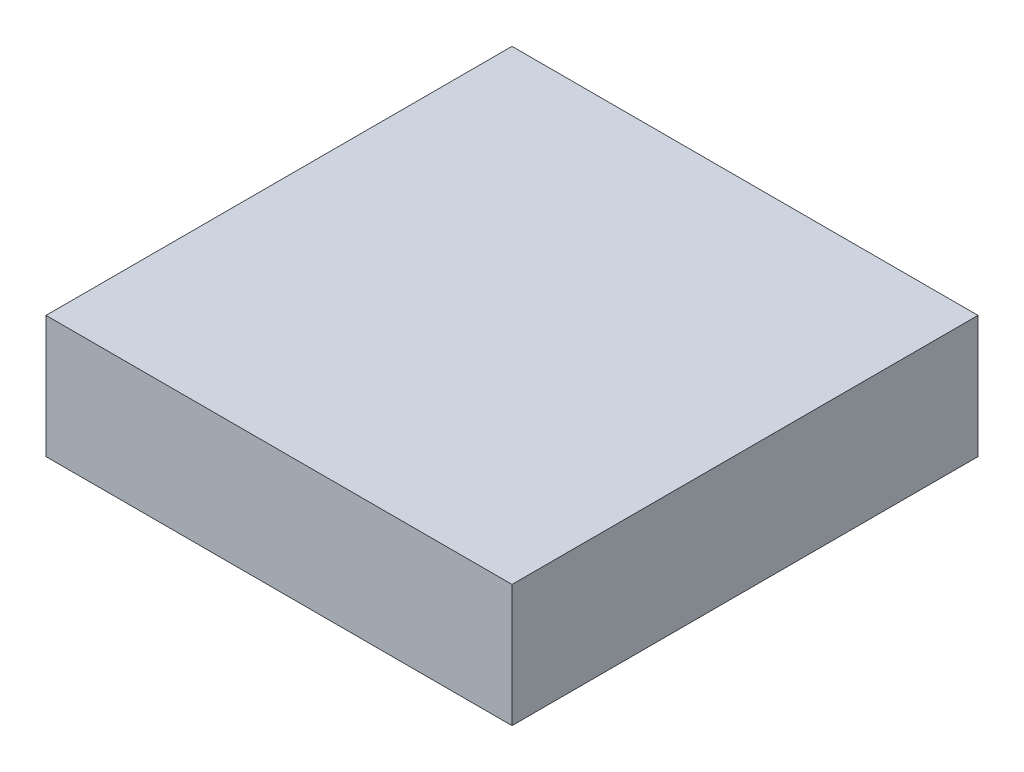
ISO-10303-21;
HEADER;
FILE_DESCRIPTION(('STEP AP214'),'2;1');
FILE_NAME('part.step','',(''),(''),'','','');
FILE_SCHEMA(('AUTOMOTIVE_DESIGN { 1 0 10303 214 1 1 1 1 }'));
ENDSEC;
DATA;
#1=APPLICATION_CONTEXT('core data for automotive mechanical design processes');
#2=APPLICATION_PROTOCOL_DEFINITION('international standard','automotive_design',2000,#1);
#3=PRODUCT_CONTEXT('',#1,'mechanical');
#4=PRODUCT('Part','Part','',(#3));
#5=PRODUCT_RELATED_PRODUCT_CATEGORY('part','',(#4));
#6=PRODUCT_DEFINITION_FORMATION('','',#4);
#7=PRODUCT_DEFINITION_CONTEXT('part definition',#1,'design');
#8=PRODUCT_DEFINITION('design','',#6,#7);
#9=PRODUCT_DEFINITION_SHAPE('','',#8);
#10=(LENGTH_UNIT() NAMED_UNIT(*) SI_UNIT(.MILLI.,.METRE.));
#11=(NAMED_UNIT(*) PLANE_ANGLE_UNIT() SI_UNIT($,.RADIAN.));
#12=(NAMED_UNIT(*) SI_UNIT($,.STERADIAN.) SOLID_ANGLE_UNIT());
#13=UNCERTAINTY_MEASURE_WITH_UNIT(LENGTH_MEASURE(1.E-05),#10,'distance_accuracy_value','');
#14=(GEOMETRIC_REPRESENTATION_CONTEXT(3) GLOBAL_UNCERTAINTY_ASSIGNED_CONTEXT((#13)) GLOBAL_UNIT_ASSIGNED_CONTEXT((#10,
#11,#12)) REPRESENTATION_CONTEXT('',''));
#15=CARTESIAN_POINT('',(0.,0.,0.));
#16=DIRECTION('',(0.,0.,1.));
#17=DIRECTION('',(1.,0.,0.));
#18=AXIS2_PLACEMENT_3D('',#15,#16,#17);
#19=CARTESIAN_POINT('',(-2.,1.05,-2.));
#20=DIRECTION('',(1.,0.,0.));
#21=DIRECTION('',(0.,0.,-1.));
#22=AXIS2_PLACEMENT_3D('',#19,#20,#21);
#23=PLANE('',#22);
#24=DIRECTION('',(0.,0.,1.));
#25=VECTOR('',#24,1.);
#26=CARTESIAN_POINT('',(-2.,0.,-2.));
#27=LINE('',#26,#25);
#28=CARTESIAN_POINT('',(-2.,0.,-2.));
#29=VERTEX_POINT('',#28);
#30=CARTESIAN_POINT('',(-2.,0.,2.));
#31=VERTEX_POINT('',#30);
#32=EDGE_CURVE('E96',#29,#31,#27,.T.);
#33=ORIENTED_EDGE('',*,*,#32,.T.);
#34=DIRECTION('',(0.,-1.,0.));
#35=VECTOR('',#34,1.);
#36=CARTESIAN_POINT('',(-2.,1.05,2.));
#37=LINE('',#36,#35);
#38=CARTESIAN_POINT('',(-2.,1.05,2.));
#39=VERTEX_POINT('',#38);
#40=EDGE_CURVE('E11',#39,#31,#37,.T.);
#41=ORIENTED_EDGE('',*,*,#40,.F.);
#42=DIRECTION('',(0.,0.,1.));
#43=VECTOR('',#42,1.);
#44=CARTESIAN_POINT('',(-2.,1.05,-2.));
#45=LINE('',#44,#43);
#46=CARTESIAN_POINT('',(-2.,1.05,-2.));
#47=VERTEX_POINT('',#46);
#48=EDGE_CURVE('E84',#47,#39,#45,.T.);
#49=ORIENTED_EDGE('',*,*,#48,.F.);
#50=DIRECTION('',(0.,-1.,0.));
#51=VECTOR('',#50,1.);
#52=CARTESIAN_POINT('',(-2.,1.05,-2.));
#53=LINE('',#52,#51);
#54=EDGE_CURVE('E92',#47,#29,#53,.T.);
#55=ORIENTED_EDGE('',*,*,#54,.T.);
#56=EDGE_LOOP('',(#33,#41,#49,#55));
#57=FACE_BOUND('',#56,.T.);
#58=ADVANCED_FACE('F33',(#57),#23,.F.);
#59=CARTESIAN_POINT('',(2.,1.05,2.));
#60=DIRECTION('',(0.,0.,-1.));
#61=DIRECTION('',(-1.,0.,0.));
#62=AXIS2_PLACEMENT_3D('',#59,#60,#61);
#63=PLANE('',#62);
#64=DIRECTION('',(1.,0.,0.));
#65=VECTOR('',#64,1.);
#66=CARTESIAN_POINT('',(2.,0.,2.));
#67=LINE('',#66,#65);
#68=CARTESIAN_POINT('',(2.,0.,2.));
#69=VERTEX_POINT('',#68);
#70=EDGE_CURVE('E88',#31,#69,#67,.T.);
#71=ORIENTED_EDGE('',*,*,#70,.T.);
#72=DIRECTION('',(0.,-1.,0.));
#73=VECTOR('',#72,1.);
#74=CARTESIAN_POINT('',(2.,1.05,2.));
#75=LINE('',#74,#73);
#76=CARTESIAN_POINT('',(2.,1.05,2.));
#77=VERTEX_POINT('',#76);
#78=EDGE_CURVE('E41',#77,#69,#75,.T.);
#79=ORIENTED_EDGE('',*,*,#78,.F.);
#80=DIRECTION('',(1.,0.,0.));
#81=VECTOR('',#80,1.);
#82=CARTESIAN_POINT('',(2.,1.05,2.));
#83=LINE('',#82,#81);
#84=EDGE_CURVE('E79',#39,#77,#83,.T.);
#85=ORIENTED_EDGE('',*,*,#84,.F.);
#86=ORIENTED_EDGE('',*,*,#40,.T.);
#87=EDGE_LOOP('',(#71,#79,#85,#86));
#88=FACE_BOUND('',#87,.T.);
#89=ADVANCED_FACE('F87',(#88),#63,.F.);
#90=CARTESIAN_POINT('',(2.,1.05,-2.));
#91=DIRECTION('',(-1.,0.,0.));
#92=DIRECTION('',(0.,0.,1.));
#93=AXIS2_PLACEMENT_3D('',#90,#91,#92);
#94=PLANE('',#93);
#95=DIRECTION('',(0.,0.,-1.));
#96=VECTOR('',#95,1.);
#97=CARTESIAN_POINT('',(2.,0.,-2.));
#98=LINE('',#97,#96);
#99=CARTESIAN_POINT('',(2.,0.,-2.));
#100=VERTEX_POINT('',#99);
#101=EDGE_CURVE('E66',#69,#100,#98,.T.);
#102=ORIENTED_EDGE('',*,*,#101,.T.);
#103=DIRECTION('',(0.,-1.,0.));
#104=VECTOR('',#103,1.);
#105=CARTESIAN_POINT('',(2.,1.05,-2.));
#106=LINE('',#105,#104);
#107=CARTESIAN_POINT('',(2.,1.05,-2.));
#108=VERTEX_POINT('',#107);
#109=EDGE_CURVE('E89',#108,#100,#106,.T.);
#110=ORIENTED_EDGE('',*,*,#109,.F.);
#111=DIRECTION('',(0.,0.,-1.));
#112=VECTOR('',#111,1.);
#113=CARTESIAN_POINT('',(2.,1.05,-2.));
#114=LINE('',#113,#112);
#115=EDGE_CURVE('E82',#77,#108,#114,.T.);
#116=ORIENTED_EDGE('',*,*,#115,.F.);
#117=ORIENTED_EDGE('',*,*,#78,.T.);
#118=EDGE_LOOP('',(#102,#110,#116,#117));
#119=FACE_BOUND('',#118,.T.);
#120=ADVANCED_FACE('F90',(#119),#94,.F.);
#121=CARTESIAN_POINT('',(2.,1.05,-2.));
#122=DIRECTION('',(0.,0.,1.));
#123=DIRECTION('',(1.,0.,0.));
#124=AXIS2_PLACEMENT_3D('',#121,#122,#123);
#125=PLANE('',#124);
#126=DIRECTION('',(-1.,0.,0.));
#127=VECTOR('',#126,1.);
#128=CARTESIAN_POINT('',(2.,0.,-2.));
#129=LINE('',#128,#127);
#130=EDGE_CURVE('E72',#100,#29,#129,.T.);
#131=ORIENTED_EDGE('',*,*,#130,.T.);
#132=ORIENTED_EDGE('',*,*,#54,.F.);
#133=DIRECTION('',(-1.,0.,0.));
#134=VECTOR('',#133,1.);
#135=CARTESIAN_POINT('',(2.,1.05,-2.));
#136=LINE('',#135,#134);
#137=EDGE_CURVE('E49',#108,#47,#136,.T.);
#138=ORIENTED_EDGE('',*,*,#137,.F.);
#139=ORIENTED_EDGE('',*,*,#109,.T.);
#140=EDGE_LOOP('',(#131,#132,#138,#139));
#141=FACE_BOUND('',#140,.T.);
#142=ADVANCED_FACE('F103',(#141),#125,.F.);
#143=CARTESIAN_POINT('',(0.,1.05,0.));
#144=DIRECTION('',(0.,-1.,0.));
#145=DIRECTION('',(0.,0.,-1.));
#146=AXIS2_PLACEMENT_3D('',#143,#144,#145);
#147=PLANE('',#146);
#148=ORIENTED_EDGE('',*,*,#48,.T.);
#149=ORIENTED_EDGE('',*,*,#84,.T.);
#150=ORIENTED_EDGE('',*,*,#115,.T.);
#151=ORIENTED_EDGE('',*,*,#137,.T.);
#152=EDGE_LOOP('',(#148,#149,#150,#151));
#153=FACE_BOUND('',#152,.T.);
#154=ADVANCED_FACE('F80',(#153),#147,.F.);
#155=CARTESIAN_POINT('',(0.,0.,0.));
#156=DIRECTION('',(0.,-1.,0.));
#157=DIRECTION('',(0.,0.,-1.));
#158=AXIS2_PLACEMENT_3D('',#155,#156,#157);
#159=PLANE('',#158);
#160=ORIENTED_EDGE('',*,*,#32,.F.);
#161=ORIENTED_EDGE('',*,*,#130,.F.);
#162=ORIENTED_EDGE('',*,*,#101,.F.);
#163=ORIENTED_EDGE('',*,*,#70,.F.);
#164=EDGE_LOOP('',(#160,#161,#162,#163));
#165=FACE_BOUND('',#164,.T.);
#166=ADVANCED_FACE('F106',(#165),#159,.T.);
#167=CLOSED_SHELL('',(#58,#89,#120,#142,#154,#166));
#168=MANIFOLD_SOLID_BREP('B2',#167);
#169=ADVANCED_BREP_SHAPE_REPRESENTATION('',(#18,#168),#14);
#170=SHAPE_DEFINITION_REPRESENTATION(#9,#169);
ENDSEC;
END-ISO-10303-21;
